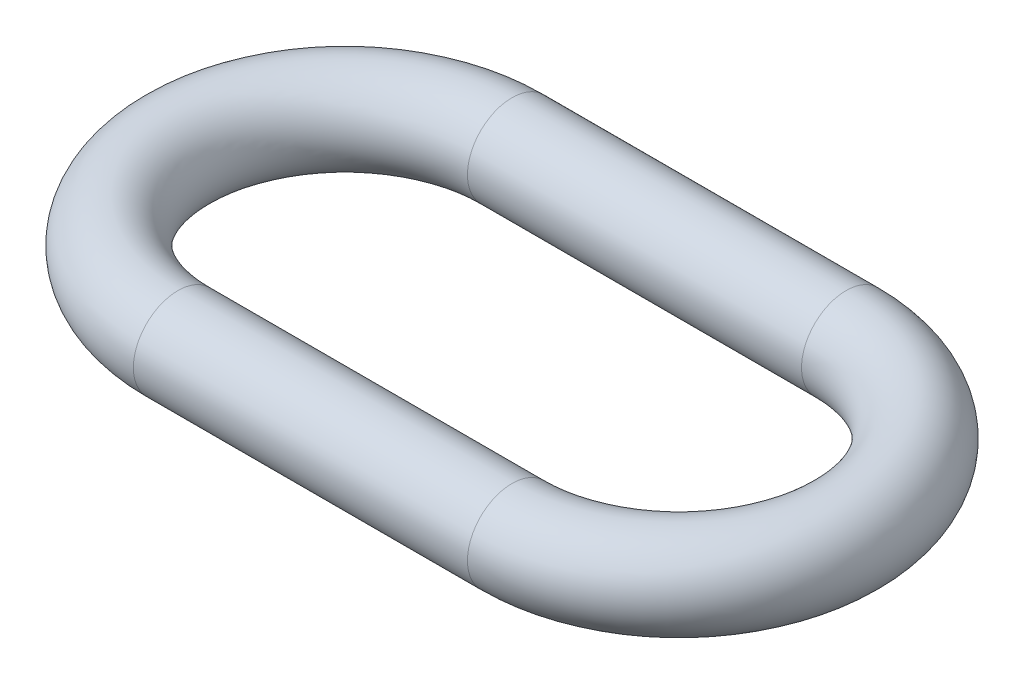
ISO-10303-21;
HEADER;
FILE_DESCRIPTION(('STEP AP214'),'2;1');
FILE_NAME('part.step','',(''),(''),'','','');
FILE_SCHEMA(('AUTOMOTIVE_DESIGN { 1 0 10303 214 1 1 1 1 }'));
ENDSEC;
DATA;
#1=APPLICATION_CONTEXT('core data for automotive mechanical design processes');
#2=APPLICATION_PROTOCOL_DEFINITION('international standard','automotive_design',2000,#1);
#3=PRODUCT_CONTEXT('',#1,'mechanical');
#4=PRODUCT('Part','Part','',(#3));
#5=PRODUCT_RELATED_PRODUCT_CATEGORY('part','',(#4));
#6=PRODUCT_DEFINITION_FORMATION('','',#4);
#7=PRODUCT_DEFINITION_CONTEXT('part definition',#1,'design');
#8=PRODUCT_DEFINITION('design','',#6,#7);
#9=PRODUCT_DEFINITION_SHAPE('','',#8);
#10=(LENGTH_UNIT() NAMED_UNIT(*) SI_UNIT(.MILLI.,.METRE.));
#11=(NAMED_UNIT(*) PLANE_ANGLE_UNIT() SI_UNIT($,.RADIAN.));
#12=(NAMED_UNIT(*) SI_UNIT($,.STERADIAN.) SOLID_ANGLE_UNIT());
#13=UNCERTAINTY_MEASURE_WITH_UNIT(LENGTH_MEASURE(1.E-05),#10,'distance_accuracy_value','');
#14=(GEOMETRIC_REPRESENTATION_CONTEXT(3) GLOBAL_UNCERTAINTY_ASSIGNED_CONTEXT((#13)) GLOBAL_UNIT_ASSIGNED_CONTEXT((#10,
#11,#12)) REPRESENTATION_CONTEXT('',''));
#15=CARTESIAN_POINT('',(0.,0.,0.));
#16=DIRECTION('',(0.,0.,1.));
#17=DIRECTION('',(1.,0.,0.));
#18=AXIS2_PLACEMENT_3D('',#15,#16,#17);
#19=CARTESIAN_POINT('',(-43.6102059647552,0.,-7.49999999999999));
#20=DIRECTION('',(1.,0.,0.));
#21=DIRECTION('',(0.,0.,-1.));
#22=AXIS2_PLACEMENT_3D('',#19,#20,#21);
#23=CYLINDRICAL_SURFACE('',#22,2.);
#24=CARTESIAN_POINT('',(-43.6102059647552,0.,-7.49999999999999));
#25=DIRECTION('',(1.,0.,0.));
#26=DIRECTION('',(0.,0.,-1.));
#27=AXIS2_PLACEMENT_3D('',#24,#25,#26);
#28=CIRCLE('',#27,2.);
#29=CARTESIAN_POINT('',(-43.6102059647551,0.,-9.49999999999999));
#30=VERTEX_POINT('',#29);
#31=EDGE_CURVE('E41',#30,#30,#28,.T.);
#32=ORIENTED_EDGE('',*,*,#31,.T.);
#33=EDGE_LOOP('',(#32));
#34=FACE_BOUND('',#33,.T.);
#35=CARTESIAN_POINT('',(-28.6102059647552,0.,-7.49999999999999));
#36=DIRECTION('',(1.,0.,0.));
#37=DIRECTION('',(0.,0.,-1.));
#38=AXIS2_PLACEMENT_3D('',#35,#36,#37);
#39=CIRCLE('',#38,2.);
#40=CARTESIAN_POINT('',(-28.6102059647552,0.,-9.49999999999999));
#41=VERTEX_POINT('',#40);
#42=EDGE_CURVE('E10',#41,#41,#39,.T.);
#43=ORIENTED_EDGE('',*,*,#42,.F.);
#44=EDGE_LOOP('',(#43));
#45=FACE_BOUND('',#44,.T.);
#46=ADVANCED_FACE('F35',(#34,#45),#23,.T.);
#47=CARTESIAN_POINT('',(-43.6102059647553,0.,0.));
#48=DIRECTION('',(0.,-1.,0.));
#49=DIRECTION('',(0.,0.,-1.));
#50=AXIS2_PLACEMENT_3D('',#47,#48,#49);
#51=TOROIDAL_SURFACE('',#50,7.5,2.);
#52=CARTESIAN_POINT('',(-43.6102059647553,0.,7.50000000000001));
#53=DIRECTION('',(-1.,0.,0.));
#54=DIRECTION('',(0.,0.,1.));
#55=AXIS2_PLACEMENT_3D('',#52,#53,#54);
#56=CIRCLE('',#55,2.);
#57=CARTESIAN_POINT('',(-43.6102059647553,0.,9.50000000000001));
#58=VERTEX_POINT('',#57);
#59=EDGE_CURVE('E45',#58,#58,#56,.T.);
#60=CARTESIAN_POINT('',(-43.6102059647553,0.,0.));
#61=DIRECTION('',(0.,-1.,0.));
#62=DIRECTION('',(0.,0.,-1.));
#63=AXIS2_PLACEMENT_3D('',#60,#61,#62);
#64=CIRCLE('',#63,9.5);
#65=EDGE_CURVE('',#58,#30,#64,.T.);
#66=ORIENTED_EDGE('',*,*,#59,.T.);
#67=ORIENTED_EDGE('',*,*,#31,.F.);
#68=ORIENTED_EDGE('',*,*,#65,.T.);
#69=ORIENTED_EDGE('',*,*,#65,.F.);
#70=EDGE_LOOP('',(#66,#68,#67,#69));
#71=FACE_BOUND('',#70,.T.);
#72=ADVANCED_FACE('F64',(#71),#51,.T.);
#73=CARTESIAN_POINT('',(-28.6102059647553,0.,7.5));
#74=DIRECTION('',(-1.,0.,0.));
#75=DIRECTION('',(0.,0.,1.));
#76=AXIS2_PLACEMENT_3D('',#73,#74,#75);
#77=CYLINDRICAL_SURFACE('',#76,2.);
#78=CARTESIAN_POINT('',(-28.6102059647553,0.,7.5));
#79=DIRECTION('',(-1.,0.,0.));
#80=DIRECTION('',(0.,0.,1.));
#81=AXIS2_PLACEMENT_3D('',#78,#79,#80);
#82=CIRCLE('',#81,2.);
#83=CARTESIAN_POINT('',(-28.6102059647553,0.,9.50000000000001));
#84=VERTEX_POINT('',#83);
#85=EDGE_CURVE('E49',#84,#84,#82,.T.);
#86=ORIENTED_EDGE('',*,*,#85,.T.);
#87=EDGE_LOOP('',(#86));
#88=FACE_BOUND('',#87,.T.);
#89=ORIENTED_EDGE('',*,*,#59,.F.);
#90=EDGE_LOOP('',(#89));
#91=FACE_BOUND('',#90,.T.);
#92=ADVANCED_FACE('F55',(#88,#91),#77,.T.);
#93=CARTESIAN_POINT('',(-28.6102059647553,0.,0.));
#94=DIRECTION('',(0.,1.,0.));
#95=DIRECTION('',(0.,0.,1.));
#96=AXIS2_PLACEMENT_3D('',#93,#94,#95);
#97=TOROIDAL_SURFACE('',#96,7.5,2.);
#98=CARTESIAN_POINT('',(-28.6102059647553,0.,0.));
#99=DIRECTION('',(0.,1.,0.));
#100=DIRECTION('',(0.,0.,1.));
#101=AXIS2_PLACEMENT_3D('',#98,#99,#100);
#102=CIRCLE('',#101,9.5);
#103=EDGE_CURVE('',#84,#41,#102,.T.);
#104=ORIENTED_EDGE('',*,*,#85,.F.);
#105=ORIENTED_EDGE('',*,*,#42,.T.);
#106=ORIENTED_EDGE('',*,*,#103,.T.);
#107=ORIENTED_EDGE('',*,*,#103,.F.);
#108=EDGE_LOOP('',(#104,#106,#105,#107));
#109=FACE_BOUND('',#108,.T.);
#110=ADVANCED_FACE('F58',(#109),#97,.T.);
#111=CLOSED_SHELL('',(#46,#72,#92,#110));
#112=MANIFOLD_SOLID_BREP('B2',#111);
#113=ADVANCED_BREP_SHAPE_REPRESENTATION('',(#18,#112),#14);
#114=SHAPE_DEFINITION_REPRESENTATION(#9,#113);
ENDSEC;
END-ISO-10303-21;
